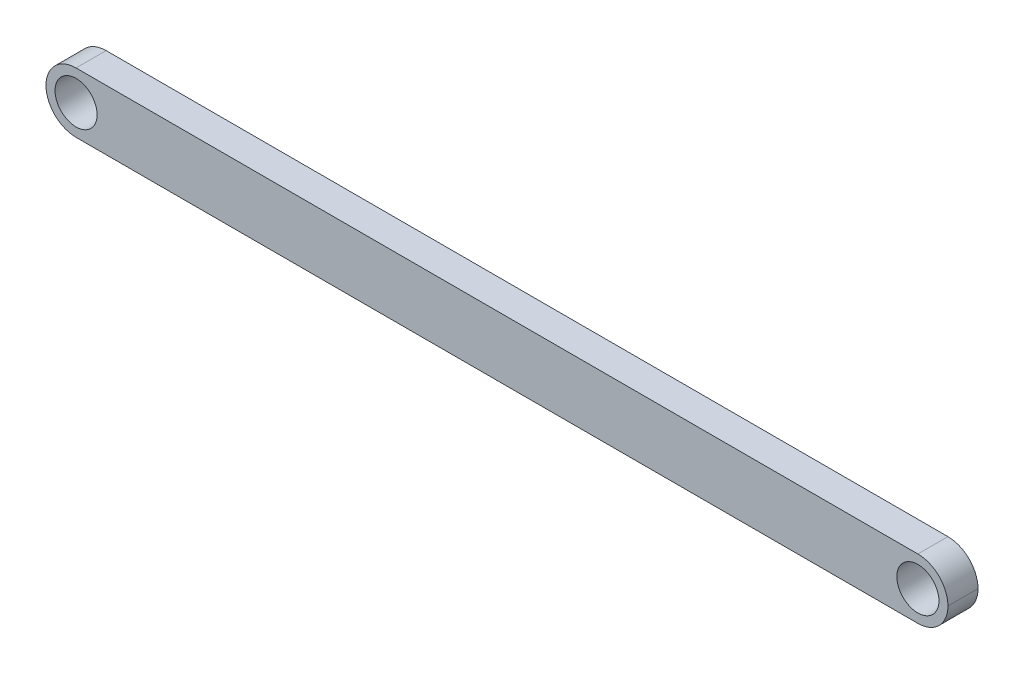
ISO-10303-21;
HEADER;
FILE_DESCRIPTION(('STEP AP214'),'2;1');
FILE_NAME('part.step','',(''),(''),'','','');
FILE_SCHEMA(('AUTOMOTIVE_DESIGN { 1 0 10303 214 1 1 1 1 }'));
ENDSEC;
DATA;
#1=APPLICATION_CONTEXT('core data for automotive mechanical design processes');
#2=APPLICATION_PROTOCOL_DEFINITION('international standard','automotive_design',2000,#1);
#3=PRODUCT_CONTEXT('',#1,'mechanical');
#4=PRODUCT('Part','Part','',(#3));
#5=PRODUCT_RELATED_PRODUCT_CATEGORY('part','',(#4));
#6=PRODUCT_DEFINITION_FORMATION('','',#4);
#7=PRODUCT_DEFINITION_CONTEXT('part definition',#1,'design');
#8=PRODUCT_DEFINITION('design','',#6,#7);
#9=PRODUCT_DEFINITION_SHAPE('','',#8);
#10=(LENGTH_UNIT() NAMED_UNIT(*) SI_UNIT(.MILLI.,.METRE.));
#11=(NAMED_UNIT(*) PLANE_ANGLE_UNIT() SI_UNIT($,.RADIAN.));
#12=(NAMED_UNIT(*) SI_UNIT($,.STERADIAN.) SOLID_ANGLE_UNIT());
#13=UNCERTAINTY_MEASURE_WITH_UNIT(LENGTH_MEASURE(1.E-05),#10,'distance_accuracy_value','');
#14=(GEOMETRIC_REPRESENTATION_CONTEXT(3) GLOBAL_UNCERTAINTY_ASSIGNED_CONTEXT((#13)) GLOBAL_UNIT_ASSIGNED_CONTEXT((#10,
#11,#12)) REPRESENTATION_CONTEXT('',''));
#15=CARTESIAN_POINT('',(0.,0.,0.));
#16=DIRECTION('',(0.,0.,1.));
#17=DIRECTION('',(1.,0.,0.));
#18=AXIS2_PLACEMENT_3D('',#15,#16,#17);
#19=CARTESIAN_POINT('',(0.,0.,10.));
#20=DIRECTION('',(0.,0.,-1.));
#21=DIRECTION('',(-1.,0.,0.));
#22=AXIS2_PLACEMENT_3D('',#19,#20,#21);
#23=PLANE('',#22);
#24=CARTESIAN_POINT('',(140.,0.,10.));
#25=DIRECTION('',(0.,0.,-1.));
#26=DIRECTION('',(-1.,0.,0.));
#27=AXIS2_PLACEMENT_3D('',#24,#25,#26);
#28=CIRCLE('',#27,10.);
#29=CARTESIAN_POINT('',(140.,-10.,10.));
#30=VERTEX_POINT('',#29);
#31=CARTESIAN_POINT('',(150.,0.,10.));
#32=VERTEX_POINT('',#31);
#33=EDGE_CURVE('E143',#30,#32,#28,.F.);
#34=ORIENTED_EDGE('',*,*,#33,.T.);
#35=CARTESIAN_POINT('',(140.,0.,10.));
#36=DIRECTION('',(0.,0.,-1.));
#37=DIRECTION('',(-1.,0.,0.));
#38=AXIS2_PLACEMENT_3D('',#35,#36,#37);
#39=CIRCLE('',#38,10.);
#40=CARTESIAN_POINT('',(140.,10.,10.));
#41=VERTEX_POINT('',#40);
#42=EDGE_CURVE('E145',#32,#41,#39,.F.);
#43=ORIENTED_EDGE('',*,*,#42,.T.);
#44=DIRECTION('',(-1.,0.,0.));
#45=VECTOR('',#44,1.);
#46=CARTESIAN_POINT('',(-150.,10.,10.));
#47=LINE('',#46,#45);
#48=CARTESIAN_POINT('',(-140.,10.,10.));
#49=VERTEX_POINT('',#48);
#50=EDGE_CURVE('E118',#41,#49,#47,.T.);
#51=ORIENTED_EDGE('',*,*,#50,.T.);
#52=CARTESIAN_POINT('',(-140.,0.,10.));
#53=DIRECTION('',(0.,0.,-1.));
#54=DIRECTION('',(-1.,0.,0.));
#55=AXIS2_PLACEMENT_3D('',#52,#53,#54);
#56=CIRCLE('',#55,10.);
#57=CARTESIAN_POINT('',(-150.,0.,10.));
#58=VERTEX_POINT('',#57);
#59=EDGE_CURVE('E108',#49,#58,#56,.F.);
#60=ORIENTED_EDGE('',*,*,#59,.T.);
#61=CARTESIAN_POINT('',(-140.,0.,10.));
#62=DIRECTION('',(0.,0.,-1.));
#63=DIRECTION('',(-1.,0.,0.));
#64=AXIS2_PLACEMENT_3D('',#61,#62,#63);
#65=CIRCLE('',#64,10.);
#66=CARTESIAN_POINT('',(-140.,-10.,10.));
#67=VERTEX_POINT('',#66);
#68=EDGE_CURVE('E66',#58,#67,#65,.F.);
#69=ORIENTED_EDGE('',*,*,#68,.T.);
#70=DIRECTION('',(1.,0.,0.));
#71=VECTOR('',#70,1.);
#72=CARTESIAN_POINT('',(-150.,-10.,10.));
#73=LINE('',#72,#71);
#74=EDGE_CURVE('E133',#67,#30,#73,.T.);
#75=ORIENTED_EDGE('',*,*,#74,.T.);
#76=EDGE_LOOP('',(#34,#43,#51,#60,#69,#75));
#77=FACE_BOUND('',#76,.T.);
#78=CARTESIAN_POINT('',(-140.,0.,10.));
#79=DIRECTION('',(0.,0.,1.));
#80=DIRECTION('',(1.,0.,0.));
#81=AXIS2_PLACEMENT_3D('',#78,#79,#80);
#82=CIRCLE('',#81,7.00000000000001);
#83=CARTESIAN_POINT('',(-133.,0.,10.));
#84=VERTEX_POINT('',#83);
#85=EDGE_CURVE('E126',#84,#84,#82,.T.);
#86=ORIENTED_EDGE('',*,*,#85,.F.);
#87=EDGE_LOOP('',(#86));
#88=FACE_BOUND('',#87,.T.);
#89=CARTESIAN_POINT('',(140.,0.,10.));
#90=DIRECTION('',(0.,0.,1.));
#91=DIRECTION('',(1.,0.,0.));
#92=AXIS2_PLACEMENT_3D('',#89,#90,#91);
#93=CIRCLE('',#92,7.00000000000001);
#94=CARTESIAN_POINT('',(147.,0.,10.));
#95=VERTEX_POINT('',#94);
#96=EDGE_CURVE('E150',#95,#95,#93,.T.);
#97=ORIENTED_EDGE('',*,*,#96,.F.);
#98=EDGE_LOOP('',(#97));
#99=FACE_BOUND('',#98,.T.);
#100=ADVANCED_FACE('F44',(#77,#88,#99),#23,.F.);
#101=CARTESIAN_POINT('',(0.,0.,0.));
#102=DIRECTION('',(0.,0.,-1.));
#103=DIRECTION('',(-1.,0.,0.));
#104=AXIS2_PLACEMENT_3D('',#101,#102,#103);
#105=PLANE('',#104);
#106=CARTESIAN_POINT('',(-140.,0.,0.));
#107=DIRECTION('',(0.,0.,1.));
#108=DIRECTION('',(1.,0.,0.));
#109=AXIS2_PLACEMENT_3D('',#106,#107,#108);
#110=CIRCLE('',#109,7.00000000000001);
#111=CARTESIAN_POINT('',(-133.,0.,0.));
#112=VERTEX_POINT('',#111);
#113=EDGE_CURVE('E131',#112,#112,#110,.T.);
#114=ORIENTED_EDGE('',*,*,#113,.T.);
#115=EDGE_LOOP('',(#114));
#116=FACE_BOUND('',#115,.T.);
#117=DIRECTION('',(-1.,0.,0.));
#118=VECTOR('',#117,1.);
#119=CARTESIAN_POINT('',(-150.,10.,0.));
#120=LINE('',#119,#118);
#121=CARTESIAN_POINT('',(140.,10.,0.));
#122=VERTEX_POINT('',#121);
#123=CARTESIAN_POINT('',(-140.,10.,0.));
#124=VERTEX_POINT('',#123);
#125=EDGE_CURVE('E115',#122,#124,#120,.T.);
#126=ORIENTED_EDGE('',*,*,#125,.F.);
#127=CARTESIAN_POINT('',(140.,0.,0.));
#128=DIRECTION('',(0.,0.,-1.));
#129=DIRECTION('',(-1.,0.,0.));
#130=AXIS2_PLACEMENT_3D('',#127,#128,#129);
#131=CIRCLE('',#130,10.);
#132=CARTESIAN_POINT('',(150.,0.,0.));
#133=VERTEX_POINT('',#132);
#134=EDGE_CURVE('E98',#122,#133,#131,.T.);
#135=ORIENTED_EDGE('',*,*,#134,.T.);
#136=CARTESIAN_POINT('',(140.,0.,0.));
#137=DIRECTION('',(0.,0.,-1.));
#138=DIRECTION('',(-1.,0.,0.));
#139=AXIS2_PLACEMENT_3D('',#136,#137,#138);
#140=CIRCLE('',#139,10.);
#141=CARTESIAN_POINT('',(140.,-10.,0.));
#142=VERTEX_POINT('',#141);
#143=EDGE_CURVE('E109',#133,#142,#140,.T.);
#144=ORIENTED_EDGE('',*,*,#143,.T.);
#145=DIRECTION('',(1.,0.,0.));
#146=VECTOR('',#145,1.);
#147=CARTESIAN_POINT('',(-150.,-10.,0.));
#148=LINE('',#147,#146);
#149=CARTESIAN_POINT('',(-140.,-10.,0.));
#150=VERTEX_POINT('',#149);
#151=EDGE_CURVE('E125',#150,#142,#148,.T.);
#152=ORIENTED_EDGE('',*,*,#151,.F.);
#153=CARTESIAN_POINT('',(-140.,0.,0.));
#154=DIRECTION('',(0.,0.,-1.));
#155=DIRECTION('',(-1.,0.,0.));
#156=AXIS2_PLACEMENT_3D('',#153,#154,#155);
#157=CIRCLE('',#156,10.);
#158=CARTESIAN_POINT('',(-150.,0.,0.));
#159=VERTEX_POINT('',#158);
#160=EDGE_CURVE('E138',#150,#159,#157,.T.);
#161=ORIENTED_EDGE('',*,*,#160,.T.);
#162=CARTESIAN_POINT('',(-140.,0.,0.));
#163=DIRECTION('',(0.,0.,-1.));
#164=DIRECTION('',(-1.,0.,0.));
#165=AXIS2_PLACEMENT_3D('',#162,#163,#164);
#166=CIRCLE('',#165,10.);
#167=EDGE_CURVE('E119',#159,#124,#166,.T.);
#168=ORIENTED_EDGE('',*,*,#167,.T.);
#169=EDGE_LOOP('',(#126,#135,#144,#152,#161,#168));
#170=FACE_BOUND('',#169,.T.);
#171=CARTESIAN_POINT('',(140.,0.,0.));
#172=DIRECTION('',(0.,0.,1.));
#173=DIRECTION('',(1.,0.,0.));
#174=AXIS2_PLACEMENT_3D('',#171,#172,#173);
#175=CIRCLE('',#174,7.00000000000001);
#176=CARTESIAN_POINT('',(147.,0.,0.));
#177=VERTEX_POINT('',#176);
#178=EDGE_CURVE('E148',#177,#177,#175,.T.);
#179=ORIENTED_EDGE('',*,*,#178,.T.);
#180=EDGE_LOOP('',(#179));
#181=FACE_BOUND('',#180,.T.);
#182=ADVANCED_FACE('F122',(#116,#170,#181),#105,.T.);
#183=CARTESIAN_POINT('',(-150.,10.,10.));
#184=DIRECTION('',(0.,-1.,0.));
#185=DIRECTION('',(0.,0.,-1.));
#186=AXIS2_PLACEMENT_3D('',#183,#184,#185);
#187=PLANE('',#186);
#188=ORIENTED_EDGE('',*,*,#50,.F.);
#189=DIRECTION('',(0.,0.,-1.));
#190=VECTOR('',#189,1.);
#191=CARTESIAN_POINT('',(140.,10.,10.));
#192=LINE('',#191,#190);
#193=EDGE_CURVE('E102',#41,#122,#192,.T.);
#194=ORIENTED_EDGE('',*,*,#193,.T.);
#195=ORIENTED_EDGE('',*,*,#125,.T.);
#196=DIRECTION('',(0.,0.,-1.));
#197=VECTOR('',#196,1.);
#198=CARTESIAN_POINT('',(-140.,10.,10.));
#199=LINE('',#198,#197);
#200=EDGE_CURVE('E120',#124,#49,#199,.F.);
#201=ORIENTED_EDGE('',*,*,#200,.T.);
#202=EDGE_LOOP('',(#188,#194,#195,#201));
#203=FACE_BOUND('',#202,.T.);
#204=ADVANCED_FACE('F114',(#203),#187,.F.);
#205=CARTESIAN_POINT('',(-150.,-10.,10.));
#206=DIRECTION('',(0.,1.,0.));
#207=DIRECTION('',(0.,0.,1.));
#208=AXIS2_PLACEMENT_3D('',#205,#206,#207);
#209=PLANE('',#208);
#210=ORIENTED_EDGE('',*,*,#151,.T.);
#211=DIRECTION('',(0.,0.,-1.));
#212=VECTOR('',#211,1.);
#213=CARTESIAN_POINT('',(140.,-10.,10.));
#214=LINE('',#213,#212);
#215=EDGE_CURVE('E12',#142,#30,#214,.F.);
#216=ORIENTED_EDGE('',*,*,#215,.T.);
#217=ORIENTED_EDGE('',*,*,#74,.F.);
#218=DIRECTION('',(0.,0.,-1.));
#219=VECTOR('',#218,1.);
#220=CARTESIAN_POINT('',(-140.,-10.,10.));
#221=LINE('',#220,#219);
#222=EDGE_CURVE('E53',#67,#150,#221,.T.);
#223=ORIENTED_EDGE('',*,*,#222,.T.);
#224=EDGE_LOOP('',(#210,#216,#217,#223));
#225=FACE_BOUND('',#224,.T.);
#226=ADVANCED_FACE('F181',(#225),#209,.F.);
#227=CARTESIAN_POINT('',(-140.,0.,10.));
#228=DIRECTION('',(0.,0.,-1.));
#229=DIRECTION('',(-1.,0.,0.));
#230=AXIS2_PLACEMENT_3D('',#227,#228,#229);
#231=CYLINDRICAL_SURFACE('',#230,7.00000000000001);
#232=ORIENTED_EDGE('',*,*,#85,.T.);
#233=EDGE_LOOP('',(#232));
#234=FACE_BOUND('',#233,.T.);
#235=ORIENTED_EDGE('',*,*,#113,.F.);
#236=EDGE_LOOP('',(#235));
#237=FACE_BOUND('',#236,.T.);
#238=ADVANCED_FACE('F178',(#234,#237),#231,.F.);
#239=CARTESIAN_POINT('',(140.,0.,10.));
#240=DIRECTION('',(0.,0.,-1.));
#241=DIRECTION('',(-1.,0.,0.));
#242=AXIS2_PLACEMENT_3D('',#239,#240,#241);
#243=CYLINDRICAL_SURFACE('',#242,7.00000000000001);
#244=ORIENTED_EDGE('',*,*,#96,.T.);
#245=EDGE_LOOP('',(#244));
#246=FACE_BOUND('',#245,.T.);
#247=ORIENTED_EDGE('',*,*,#178,.F.);
#248=EDGE_LOOP('',(#247));
#249=FACE_BOUND('',#248,.T.);
#250=ADVANCED_FACE('F167',(#246,#249),#243,.F.);
#251=CARTESIAN_POINT('',(140.,0.,10.));
#252=DIRECTION('',(0.,0.,-1.));
#253=DIRECTION('',(-1.,0.,0.));
#254=AXIS2_PLACEMENT_3D('',#251,#252,#253);
#255=CYLINDRICAL_SURFACE('',#254,10.);
#256=DIRECTION('',(0.,0.,-1.));
#257=VECTOR('',#256,1.);
#258=CARTESIAN_POINT('',(150.,0.,10.));
#259=LINE('',#258,#257);
#260=EDGE_CURVE('E104',#32,#133,#259,.T.);
#261=ORIENTED_EDGE('',*,*,#260,.F.);
#262=ORIENTED_EDGE('',*,*,#33,.F.);
#263=ORIENTED_EDGE('',*,*,#215,.F.);
#264=ORIENTED_EDGE('',*,*,#143,.F.);
#265=EDGE_LOOP('',(#261,#262,#263,#264));
#266=FACE_BOUND('',#265,.T.);
#267=ADVANCED_FACE('F188',(#266),#255,.T.);
#268=CARTESIAN_POINT('',(140.,0.,10.));
#269=DIRECTION('',(0.,0.,-1.));
#270=DIRECTION('',(-1.,0.,0.));
#271=AXIS2_PLACEMENT_3D('',#268,#269,#270);
#272=CYLINDRICAL_SURFACE('',#271,10.);
#273=ORIENTED_EDGE('',*,*,#42,.F.);
#274=ORIENTED_EDGE('',*,*,#260,.T.);
#275=ORIENTED_EDGE('',*,*,#134,.F.);
#276=ORIENTED_EDGE('',*,*,#193,.F.);
#277=EDGE_LOOP('',(#273,#274,#275,#276));
#278=FACE_BOUND('',#277,.T.);
#279=ADVANCED_FACE('F101',(#278),#272,.T.);
#280=CARTESIAN_POINT('',(-140.,0.,10.));
#281=DIRECTION('',(0.,0.,-1.));
#282=DIRECTION('',(-1.,0.,0.));
#283=AXIS2_PLACEMENT_3D('',#280,#281,#282);
#284=CYLINDRICAL_SURFACE('',#283,10.);
#285=DIRECTION('',(0.,0.,-1.));
#286=VECTOR('',#285,1.);
#287=CARTESIAN_POINT('',(-150.,0.,10.));
#288=LINE('',#287,#286);
#289=EDGE_CURVE('E48',#58,#159,#288,.T.);
#290=ORIENTED_EDGE('',*,*,#289,.F.);
#291=ORIENTED_EDGE('',*,*,#59,.F.);
#292=ORIENTED_EDGE('',*,*,#200,.F.);
#293=ORIENTED_EDGE('',*,*,#167,.F.);
#294=EDGE_LOOP('',(#290,#291,#292,#293));
#295=FACE_BOUND('',#294,.T.);
#296=ADVANCED_FACE('F46',(#295),#284,.T.);
#297=CARTESIAN_POINT('',(-140.,0.,10.));
#298=DIRECTION('',(0.,0.,-1.));
#299=DIRECTION('',(-1.,0.,0.));
#300=AXIS2_PLACEMENT_3D('',#297,#298,#299);
#301=CYLINDRICAL_SURFACE('',#300,10.);
#302=ORIENTED_EDGE('',*,*,#68,.F.);
#303=ORIENTED_EDGE('',*,*,#289,.T.);
#304=ORIENTED_EDGE('',*,*,#160,.F.);
#305=ORIENTED_EDGE('',*,*,#222,.F.);
#306=EDGE_LOOP('',(#302,#303,#304,#305));
#307=FACE_BOUND('',#306,.T.);
#308=ADVANCED_FACE('F155',(#307),#301,.T.);
#309=CLOSED_SHELL('',(#100,#182,#204,#226,#238,#250,#267,#279,#296,#308));
#310=MANIFOLD_SOLID_BREP('B2',#309);
#311=ADVANCED_BREP_SHAPE_REPRESENTATION('',(#18,#310),#14);
#312=SHAPE_DEFINITION_REPRESENTATION(#9,#311);
ENDSEC;
END-ISO-10303-21;
